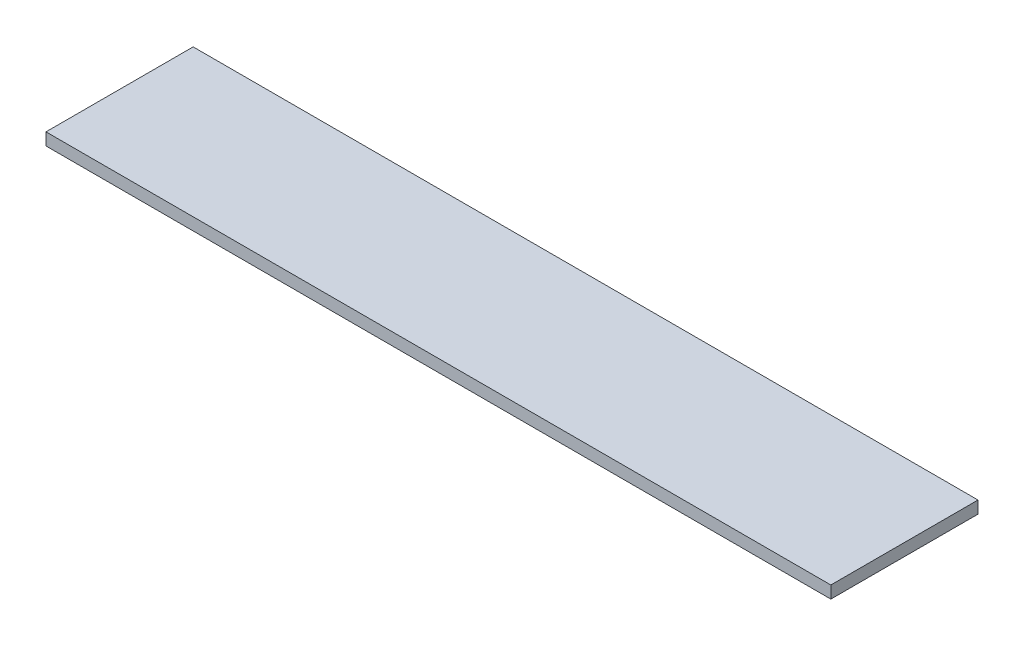
ISO-10303-21;
HEADER;
FILE_DESCRIPTION(('STEP AP214'),'2;1');
FILE_NAME('part.step','',(''),(''),'','','');
FILE_SCHEMA(('AUTOMOTIVE_DESIGN { 1 0 10303 214 1 1 1 1 }'));
ENDSEC;
DATA;
#1=APPLICATION_CONTEXT('core data for automotive mechanical design processes');
#2=APPLICATION_PROTOCOL_DEFINITION('international standard','automotive_design',2000,#1);
#3=PRODUCT_CONTEXT('',#1,'mechanical');
#4=PRODUCT('Part','Part','',(#3));
#5=PRODUCT_RELATED_PRODUCT_CATEGORY('part','',(#4));
#6=PRODUCT_DEFINITION_FORMATION('','',#4);
#7=PRODUCT_DEFINITION_CONTEXT('part definition',#1,'design');
#8=PRODUCT_DEFINITION('design','',#6,#7);
#9=PRODUCT_DEFINITION_SHAPE('','',#8);
#10=(LENGTH_UNIT() NAMED_UNIT(*) SI_UNIT(.MILLI.,.METRE.));
#11=(NAMED_UNIT(*) PLANE_ANGLE_UNIT() SI_UNIT($,.RADIAN.));
#12=(NAMED_UNIT(*) SI_UNIT($,.STERADIAN.) SOLID_ANGLE_UNIT());
#13=UNCERTAINTY_MEASURE_WITH_UNIT(LENGTH_MEASURE(1.E-05),#10,'distance_accuracy_value','');
#14=(GEOMETRIC_REPRESENTATION_CONTEXT(3) GLOBAL_UNCERTAINTY_ASSIGNED_CONTEXT((#13)) GLOBAL_UNIT_ASSIGNED_CONTEXT((#10,
#11,#12)) REPRESENTATION_CONTEXT('',''));
#15=CARTESIAN_POINT('',(0.,0.,0.));
#16=DIRECTION('',(0.,0.,1.));
#17=DIRECTION('',(1.,0.,0.));
#18=AXIS2_PLACEMENT_3D('',#15,#16,#17);
#19=CARTESIAN_POINT('',(0.,6.35,0.));
#20=DIRECTION('',(0.,1.,0.));
#21=DIRECTION('',(0.,0.,1.));
#22=AXIS2_PLACEMENT_3D('',#19,#20,#21);
#23=PLANE('',#22);
#24=DIRECTION('',(0.,0.,1.));
#25=VECTOR('',#24,1.);
#26=CARTESIAN_POINT('',(0.,6.35,-76.2));
#27=LINE('',#26,#25);
#28=CARTESIAN_POINT('',(0.,6.35,0.));
#29=VERTEX_POINT('',#28);
#30=CARTESIAN_POINT('',(0.,6.35,-76.2));
#31=VERTEX_POINT('',#30);
#32=EDGE_CURVE('E68',#29,#31,#27,.F.);
#33=ORIENTED_EDGE('',*,*,#32,.F.);
#34=DIRECTION('',(1.,0.,0.));
#35=VECTOR('',#34,1.);
#36=CARTESIAN_POINT('',(0.,6.35,0.));
#37=LINE('',#36,#35);
#38=CARTESIAN_POINT('',(406.4,6.35,0.));
#39=VERTEX_POINT('',#38);
#40=EDGE_CURVE('E20',#39,#29,#37,.F.);
#41=ORIENTED_EDGE('',*,*,#40,.F.);
#42=DIRECTION('',(0.,0.,-1.));
#43=VECTOR('',#42,1.);
#44=CARTESIAN_POINT('',(406.4,6.35,0.));
#45=LINE('',#44,#43);
#46=CARTESIAN_POINT('',(406.4,6.35,-76.2));
#47=VERTEX_POINT('',#46);
#48=EDGE_CURVE('E58',#47,#39,#45,.F.);
#49=ORIENTED_EDGE('',*,*,#48,.F.);
#50=DIRECTION('',(-1.,0.,0.));
#51=VECTOR('',#50,1.);
#52=CARTESIAN_POINT('',(406.4,6.35,-76.2));
#53=LINE('',#52,#51);
#54=EDGE_CURVE('E53',#31,#47,#53,.F.);
#55=ORIENTED_EDGE('',*,*,#54,.F.);
#56=EDGE_LOOP('',(#33,#41,#49,#55));
#57=FACE_BOUND('',#56,.T.);
#58=ADVANCED_FACE('F17',(#57),#23,.T.);
#59=CARTESIAN_POINT('',(0.,0.,0.));
#60=DIRECTION('',(0.,0.,1.));
#61=DIRECTION('',(1.,0.,0.));
#62=AXIS2_PLACEMENT_3D('',#59,#60,#61);
#63=PLANE('',#62);
#64=DIRECTION('',(0.,1.,0.));
#65=VECTOR('',#64,1.);
#66=CARTESIAN_POINT('',(0.,0.,0.));
#67=LINE('',#66,#65);
#68=CARTESIAN_POINT('',(0.,0.,0.));
#69=VERTEX_POINT('',#68);
#70=EDGE_CURVE('E79',#69,#29,#67,.T.);
#71=ORIENTED_EDGE('',*,*,#70,.F.);
#72=DIRECTION('',(1.,0.,0.));
#73=VECTOR('',#72,1.);
#74=CARTESIAN_POINT('',(0.,0.,0.));
#75=LINE('',#74,#73);
#76=CARTESIAN_POINT('',(406.4,0.,0.));
#77=VERTEX_POINT('',#76);
#78=EDGE_CURVE('E74',#69,#77,#75,.T.);
#79=ORIENTED_EDGE('',*,*,#78,.T.);
#80=DIRECTION('',(0.,1.,0.));
#81=VECTOR('',#80,1.);
#82=CARTESIAN_POINT('',(406.4,0.,0.));
#83=LINE('',#82,#81);
#84=EDGE_CURVE('E63',#39,#77,#83,.F.);
#85=ORIENTED_EDGE('',*,*,#84,.F.);
#86=ORIENTED_EDGE('',*,*,#40,.T.);
#87=EDGE_LOOP('',(#71,#79,#85,#86));
#88=FACE_BOUND('',#87,.T.);
#89=ADVANCED_FACE('F73',(#88),#63,.T.);
#90=CARTESIAN_POINT('',(406.4,0.,0.));
#91=DIRECTION('',(1.,0.,0.));
#92=DIRECTION('',(0.,0.,-1.));
#93=AXIS2_PLACEMENT_3D('',#90,#91,#92);
#94=PLANE('',#93);
#95=ORIENTED_EDGE('',*,*,#84,.T.);
#96=DIRECTION('',(0.,0.,1.));
#97=VECTOR('',#96,1.);
#98=CARTESIAN_POINT('',(406.4,0.,0.));
#99=LINE('',#98,#97);
#100=CARTESIAN_POINT('',(406.4,0.,-76.2));
#101=VERTEX_POINT('',#100);
#102=EDGE_CURVE('E84',#77,#101,#99,.F.);
#103=ORIENTED_EDGE('',*,*,#102,.T.);
#104=DIRECTION('',(0.,1.,0.));
#105=VECTOR('',#104,1.);
#106=CARTESIAN_POINT('',(406.4,0.,-76.2));
#107=LINE('',#106,#105);
#108=EDGE_CURVE('E65',#47,#101,#107,.F.);
#109=ORIENTED_EDGE('',*,*,#108,.F.);
#110=ORIENTED_EDGE('',*,*,#48,.T.);
#111=EDGE_LOOP('',(#95,#103,#109,#110));
#112=FACE_BOUND('',#111,.T.);
#113=ADVANCED_FACE('F60',(#112),#94,.T.);
#114=CARTESIAN_POINT('',(406.4,0.,-76.2));
#115=DIRECTION('',(0.,0.,-1.));
#116=DIRECTION('',(-1.,0.,0.));
#117=AXIS2_PLACEMENT_3D('',#114,#115,#116);
#118=PLANE('',#117);
#119=ORIENTED_EDGE('',*,*,#108,.T.);
#120=DIRECTION('',(1.,0.,0.));
#121=VECTOR('',#120,1.);
#122=CARTESIAN_POINT('',(0.,0.,-76.2));
#123=LINE('',#122,#121);
#124=CARTESIAN_POINT('',(0.,0.,-76.2));
#125=VERTEX_POINT('',#124);
#126=EDGE_CURVE('E26',#101,#125,#123,.F.);
#127=ORIENTED_EDGE('',*,*,#126,.T.);
#128=DIRECTION('',(0.,1.,0.));
#129=VECTOR('',#128,1.);
#130=CARTESIAN_POINT('',(0.,0.,-76.2));
#131=LINE('',#130,#129);
#132=EDGE_CURVE('E34',#31,#125,#131,.F.);
#133=ORIENTED_EDGE('',*,*,#132,.F.);
#134=ORIENTED_EDGE('',*,*,#54,.T.);
#135=EDGE_LOOP('',(#119,#127,#133,#134));
#136=FACE_BOUND('',#135,.T.);
#137=ADVANCED_FACE('F88',(#136),#118,.T.);
#138=CARTESIAN_POINT('',(0.,0.,-76.2));
#139=DIRECTION('',(-1.,0.,0.));
#140=DIRECTION('',(0.,0.,1.));
#141=AXIS2_PLACEMENT_3D('',#138,#139,#140);
#142=PLANE('',#141);
#143=ORIENTED_EDGE('',*,*,#132,.T.);
#144=DIRECTION('',(0.,0.,1.));
#145=VECTOR('',#144,1.);
#146=CARTESIAN_POINT('',(0.,0.,0.));
#147=LINE('',#146,#145);
#148=EDGE_CURVE('E11',#125,#69,#147,.T.);
#149=ORIENTED_EDGE('',*,*,#148,.T.);
#150=ORIENTED_EDGE('',*,*,#70,.T.);
#151=ORIENTED_EDGE('',*,*,#32,.T.);
#152=EDGE_LOOP('',(#143,#149,#150,#151));
#153=FACE_BOUND('',#152,.T.);
#154=ADVANCED_FACE('F91',(#153),#142,.T.);
#155=CARTESIAN_POINT('',(0.,0.,0.));
#156=DIRECTION('',(0.,1.,0.));
#157=DIRECTION('',(0.,0.,1.));
#158=AXIS2_PLACEMENT_3D('',#155,#156,#157);
#159=PLANE('',#158);
#160=ORIENTED_EDGE('',*,*,#126,.F.);
#161=ORIENTED_EDGE('',*,*,#102,.F.);
#162=ORIENTED_EDGE('',*,*,#78,.F.);
#163=ORIENTED_EDGE('',*,*,#148,.F.);
#164=EDGE_LOOP('',(#160,#161,#162,#163));
#165=FACE_BOUND('',#164,.T.);
#166=ADVANCED_FACE('F90',(#165),#159,.F.);
#167=CLOSED_SHELL('',(#58,#89,#113,#137,#154,#166));
#168=MANIFOLD_SOLID_BREP('B1',#167);
#169=ADVANCED_BREP_SHAPE_REPRESENTATION('',(#18,#168),#14);
#170=SHAPE_DEFINITION_REPRESENTATION(#9,#169);
ENDSEC;
END-ISO-10303-21;
